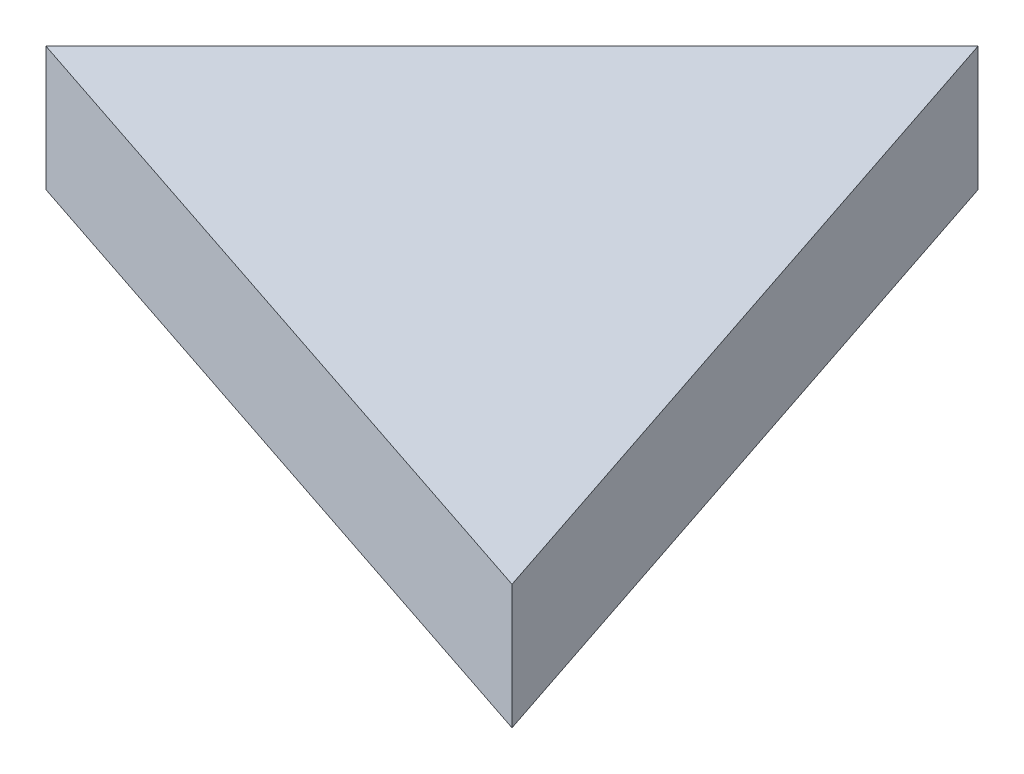
ISO-10303-21;
HEADER;
FILE_DESCRIPTION(('STEP AP214'),'2;1');
FILE_NAME('part.step','',(''),(''),'','','');
FILE_SCHEMA(('AUTOMOTIVE_DESIGN { 1 0 10303 214 1 1 1 1 }'));
ENDSEC;
DATA;
#1=APPLICATION_CONTEXT('core data for automotive mechanical design processes');
#2=APPLICATION_PROTOCOL_DEFINITION('international standard','automotive_design',2000,#1);
#3=PRODUCT_CONTEXT('',#1,'mechanical');
#4=PRODUCT('Part','Part','',(#3));
#5=PRODUCT_RELATED_PRODUCT_CATEGORY('part','',(#4));
#6=PRODUCT_DEFINITION_FORMATION('','',#4);
#7=PRODUCT_DEFINITION_CONTEXT('part definition',#1,'design');
#8=PRODUCT_DEFINITION('design','',#6,#7);
#9=PRODUCT_DEFINITION_SHAPE('','',#8);
#10=(LENGTH_UNIT() NAMED_UNIT(*) SI_UNIT(.MILLI.,.METRE.));
#11=(NAMED_UNIT(*) PLANE_ANGLE_UNIT() SI_UNIT($,.RADIAN.));
#12=(NAMED_UNIT(*) SI_UNIT($,.STERADIAN.) SOLID_ANGLE_UNIT());
#13=UNCERTAINTY_MEASURE_WITH_UNIT(LENGTH_MEASURE(1.E-05),#10,'distance_accuracy_value','');
#14=(GEOMETRIC_REPRESENTATION_CONTEXT(3) GLOBAL_UNCERTAINTY_ASSIGNED_CONTEXT((#13)) GLOBAL_UNIT_ASSIGNED_CONTEXT((#10,
#11,#12)) REPRESENTATION_CONTEXT('',''));
#15=CARTESIAN_POINT('',(0.,0.,0.));
#16=DIRECTION('',(0.,0.,1.));
#17=DIRECTION('',(1.,0.,0.));
#18=AXIS2_PLACEMENT_3D('',#15,#16,#17);
#19=CARTESIAN_POINT('',(17.2000000000003,6.4,-51.6000000000001));
#20=DIRECTION('',(0.316227766016841,0.,-0.948683298050513));
#21=DIRECTION('',(-0.948683298050513,0.,-0.316227766016841));
#22=AXIS2_PLACEMENT_3D('',#19,#20,#21);
#23=PLANE('',#22);
#24=DIRECTION('',(0.948683298050513,0.,0.316227766016841));
#25=VECTOR('',#24,1.);
#26=CARTESIAN_POINT('',(17.2000000000003,0.,-51.6000000000001));
#27=LINE('',#26,#25);
#28=CARTESIAN_POINT('',(28.0000000000001,0.,-48.0000000000001));
#29=VERTEX_POINT('',#28);
#30=CARTESIAN_POINT('',(64.0000000000001,0.,-36.));
#31=VERTEX_POINT('',#30);
#32=EDGE_CURVE('E81',#29,#31,#27,.T.);
#33=ORIENTED_EDGE('',*,*,#32,.T.);
#34=DIRECTION('',(0.,-1.,0.));
#35=VECTOR('',#34,1.);
#36=CARTESIAN_POINT('',(64.0000000000001,6.4,-36.));
#37=LINE('',#36,#35);
#38=CARTESIAN_POINT('',(64.0000000000001,6.4,-36.));
#39=VERTEX_POINT('',#38);
#40=EDGE_CURVE('E11',#39,#31,#37,.T.);
#41=ORIENTED_EDGE('',*,*,#40,.F.);
#42=DIRECTION('',(0.948683298050513,0.,0.316227766016841));
#43=VECTOR('',#42,1.);
#44=CARTESIAN_POINT('',(17.2000000000003,6.4,-51.6000000000001));
#45=LINE('',#44,#43);
#46=CARTESIAN_POINT('',(28.0000000000001,6.4,-48.0000000000001));
#47=VERTEX_POINT('',#46);
#48=EDGE_CURVE('E76',#47,#39,#45,.T.);
#49=ORIENTED_EDGE('',*,*,#48,.F.);
#50=DIRECTION('',(0.,-1.,0.));
#51=VECTOR('',#50,1.);
#52=CARTESIAN_POINT('',(28.0000000000001,6.4,-48.0000000000001));
#53=LINE('',#52,#51);
#54=EDGE_CURVE('E51',#47,#29,#53,.T.);
#55=ORIENTED_EDGE('',*,*,#54,.T.);
#56=EDGE_LOOP('',(#33,#41,#49,#55));
#57=FACE_BOUND('',#56,.T.);
#58=ADVANCED_FACE('F35',(#57),#23,.F.);
#59=CARTESIAN_POINT('',(68.4000000000001,6.4,-22.8000000000003));
#60=DIRECTION('',(-0.948683298050513,0.,0.316227766016841));
#61=DIRECTION('',(0.316227766016841,0.,0.948683298050513));
#62=AXIS2_PLACEMENT_3D('',#59,#60,#61);
#63=PLANE('',#62);
#64=DIRECTION('',(-0.316227766016841,0.,-0.948683298050513));
#65=VECTOR('',#64,1.);
#66=CARTESIAN_POINT('',(68.4000000000001,0.,-22.8000000000003));
#67=LINE('',#66,#65);
#68=CARTESIAN_POINT('',(52.,0.,-72.));
#69=VERTEX_POINT('',#68);
#70=EDGE_CURVE('E84',#31,#69,#67,.T.);
#71=ORIENTED_EDGE('',*,*,#70,.T.);
#72=DIRECTION('',(0.,-1.,0.));
#73=VECTOR('',#72,1.);
#74=CARTESIAN_POINT('',(52.,6.4,-72.));
#75=LINE('',#74,#73);
#76=CARTESIAN_POINT('',(52.,6.4,-72.));
#77=VERTEX_POINT('',#76);
#78=EDGE_CURVE('E43',#77,#69,#75,.T.);
#79=ORIENTED_EDGE('',*,*,#78,.F.);
#80=DIRECTION('',(-0.316227766016841,0.,-0.948683298050513));
#81=VECTOR('',#80,1.);
#82=CARTESIAN_POINT('',(68.4000000000001,6.4,-22.8000000000003));
#83=LINE('',#82,#81);
#84=EDGE_CURVE('E69',#39,#77,#83,.T.);
#85=ORIENTED_EDGE('',*,*,#84,.F.);
#86=ORIENTED_EDGE('',*,*,#40,.T.);
#87=EDGE_LOOP('',(#71,#79,#85,#86));
#88=FACE_BOUND('',#87,.T.);
#89=ADVANCED_FACE('F71',(#88),#63,.F.);
#90=CARTESIAN_POINT('',(-10.,6.4,-10.));
#91=DIRECTION('',(-0.707106781186548,0.,-0.707106781186548));
#92=DIRECTION('',(-0.707106781186548,0.,0.707106781186548));
#93=AXIS2_PLACEMENT_3D('',#90,#91,#92);
#94=PLANE('',#93);
#95=DIRECTION('',(0.707106781186548,0.,-0.707106781186548));
#96=VECTOR('',#95,1.);
#97=CARTESIAN_POINT('',(-10.,0.,-10.));
#98=LINE('',#97,#96);
#99=EDGE_CURVE('E79',#29,#69,#98,.T.);
#100=ORIENTED_EDGE('',*,*,#99,.F.);
#101=ORIENTED_EDGE('',*,*,#54,.F.);
#102=DIRECTION('',(0.707106781186548,0.,-0.707106781186548));
#103=VECTOR('',#102,1.);
#104=CARTESIAN_POINT('',(-10.,6.4,-10.));
#105=LINE('',#104,#103);
#106=EDGE_CURVE('E75',#47,#77,#105,.T.);
#107=ORIENTED_EDGE('',*,*,#106,.T.);
#108=ORIENTED_EDGE('',*,*,#78,.T.);
#109=EDGE_LOOP('',(#100,#101,#107,#108));
#110=FACE_BOUND('',#109,.T.);
#111=ADVANCED_FACE('F90',(#110),#94,.T.);
#112=CARTESIAN_POINT('',(0.,6.4,0.));
#113=DIRECTION('',(0.,1.,0.));
#114=DIRECTION('',(0.,0.,1.));
#115=AXIS2_PLACEMENT_3D('',#112,#113,#114);
#116=PLANE('',#115);
#117=ORIENTED_EDGE('',*,*,#48,.T.);
#118=ORIENTED_EDGE('',*,*,#84,.T.);
#119=ORIENTED_EDGE('',*,*,#106,.F.);
#120=EDGE_LOOP('',(#117,#118,#119));
#121=FACE_BOUND('',#120,.T.);
#122=ADVANCED_FACE('F78',(#121),#116,.T.);
#123=CARTESIAN_POINT('',(0.,0.,0.));
#124=DIRECTION('',(0.,1.,0.));
#125=DIRECTION('',(0.,0.,1.));
#126=AXIS2_PLACEMENT_3D('',#123,#124,#125);
#127=PLANE('',#126);
#128=ORIENTED_EDGE('',*,*,#32,.F.);
#129=ORIENTED_EDGE('',*,*,#99,.T.);
#130=ORIENTED_EDGE('',*,*,#70,.F.);
#131=EDGE_LOOP('',(#128,#129,#130));
#132=FACE_BOUND('',#131,.T.);
#133=ADVANCED_FACE('F97',(#132),#127,.F.);
#134=CLOSED_SHELL('',(#58,#89,#111,#122,#133));
#135=MANIFOLD_SOLID_BREP('B2',#134);
#136=ADVANCED_BREP_SHAPE_REPRESENTATION('',(#18,#135),#14);
#137=SHAPE_DEFINITION_REPRESENTATION(#9,#136);
ENDSEC;
END-ISO-10303-21;
